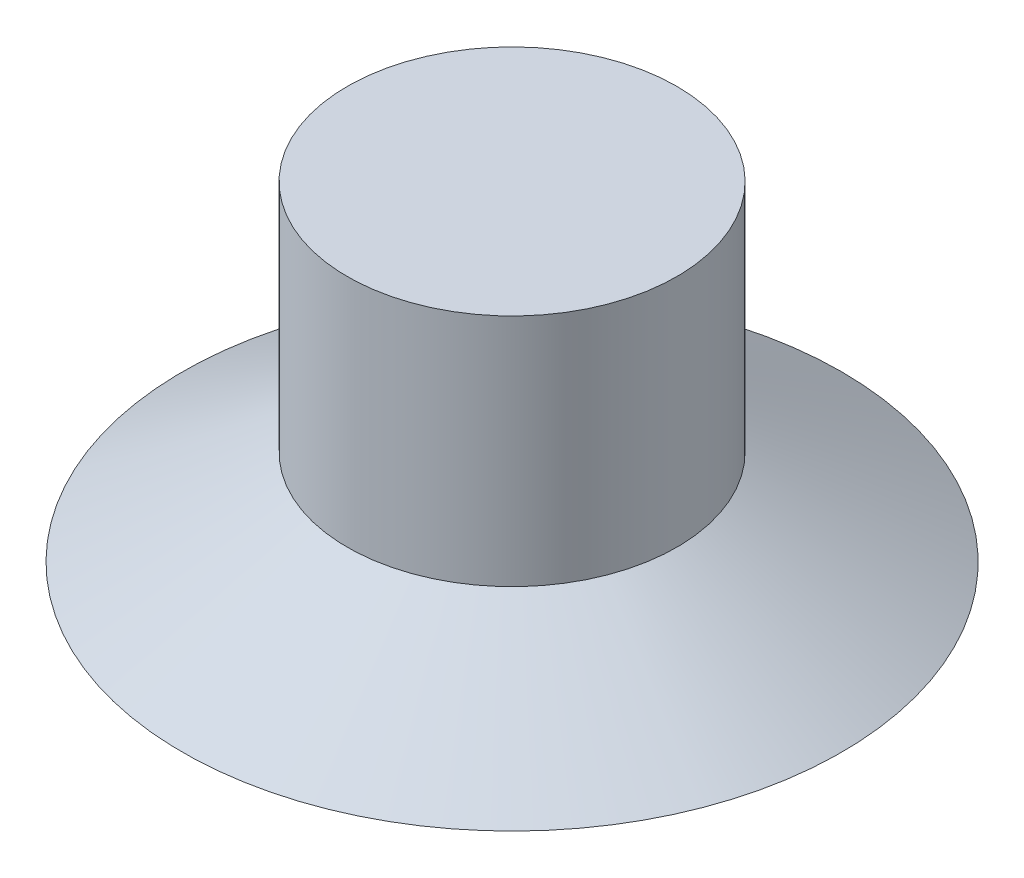
ISO-10303-21;
HEADER;
FILE_DESCRIPTION(('STEP AP214'),'2;1');
FILE_NAME('part.step','',(''),(''),'','','');
FILE_SCHEMA(('AUTOMOTIVE_DESIGN { 1 0 10303 214 1 1 1 1 }'));
ENDSEC;
DATA;
#1=APPLICATION_CONTEXT('core data for automotive mechanical design processes');
#2=APPLICATION_PROTOCOL_DEFINITION('international standard','automotive_design',2000,#1);
#3=PRODUCT_CONTEXT('',#1,'mechanical');
#4=PRODUCT('Part','Part','',(#3));
#5=PRODUCT_RELATED_PRODUCT_CATEGORY('part','',(#4));
#6=PRODUCT_DEFINITION_FORMATION('','',#4);
#7=PRODUCT_DEFINITION_CONTEXT('part definition',#1,'design');
#8=PRODUCT_DEFINITION('design','',#6,#7);
#9=PRODUCT_DEFINITION_SHAPE('','',#8);
#10=(LENGTH_UNIT() NAMED_UNIT(*) SI_UNIT(.MILLI.,.METRE.));
#11=(NAMED_UNIT(*) PLANE_ANGLE_UNIT() SI_UNIT($,.RADIAN.));
#12=(NAMED_UNIT(*) SI_UNIT($,.STERADIAN.) SOLID_ANGLE_UNIT());
#13=UNCERTAINTY_MEASURE_WITH_UNIT(LENGTH_MEASURE(1.E-05),#10,'distance_accuracy_value','');
#14=(GEOMETRIC_REPRESENTATION_CONTEXT(3) GLOBAL_UNCERTAINTY_ASSIGNED_CONTEXT((#13)) GLOBAL_UNIT_ASSIGNED_CONTEXT((#10,
#11,#12)) REPRESENTATION_CONTEXT('',''));
#15=CARTESIAN_POINT('',(0.,0.,0.));
#16=DIRECTION('',(0.,0.,1.));
#17=DIRECTION('',(1.,0.,0.));
#18=AXIS2_PLACEMENT_3D('',#15,#16,#17);
#19=CARTESIAN_POINT('',(0.,0.,0.));
#20=DIRECTION('',(0.,-1.,0.));
#21=DIRECTION('',(0.,0.,-1.));
#22=AXIS2_PLACEMENT_3D('',#19,#20,#21);
#23=PLANE('',#22);
#24=DIRECTION('',(0.499999999999998,0.,-0.86602540378444));
#25=VECTOR('',#24,1.);
#26=CARTESIAN_POINT('',(-1.73205080756889,0.,-3.));
#27=LINE('',#26,#25);
#28=CARTESIAN_POINT('',(-3.46410161513776,0.,0.));
#29=VERTEX_POINT('',#28);
#30=CARTESIAN_POINT('',(-1.73205080756889,0.,-3.));
#31=VERTEX_POINT('',#30);
#32=EDGE_CURVE('E45',#29,#31,#27,.T.);
#33=ORIENTED_EDGE('',*,*,#32,.F.);
#34=DIRECTION('',(-0.500000000000005,0.,-0.866025403784436));
#35=VECTOR('',#34,1.);
#36=CARTESIAN_POINT('',(-3.46410161513776,0.,0.));
#37=LINE('',#36,#35);
#38=CARTESIAN_POINT('',(-1.73205080756887,0.,3.));
#39=VERTEX_POINT('',#38);
#40=EDGE_CURVE('E114',#39,#29,#37,.T.);
#41=ORIENTED_EDGE('',*,*,#40,.F.);
#42=DIRECTION('',(-1.,0.,0.));
#43=VECTOR('',#42,1.);
#44=CARTESIAN_POINT('',(-1.73205080756887,0.,3.));
#45=LINE('',#44,#43);
#46=CARTESIAN_POINT('',(1.73205080756889,0.,3.));
#47=VERTEX_POINT('',#46);
#48=EDGE_CURVE('E108',#47,#39,#45,.T.);
#49=ORIENTED_EDGE('',*,*,#48,.F.);
#50=DIRECTION('',(-0.499999999999998,0.,0.86602540378444));
#51=VECTOR('',#50,1.);
#52=CARTESIAN_POINT('',(1.73205080756889,0.,3.));
#53=LINE('',#52,#51);
#54=CARTESIAN_POINT('',(3.46410161513776,0.,0.));
#55=VERTEX_POINT('',#54);
#56=EDGE_CURVE('E106',#55,#47,#53,.T.);
#57=ORIENTED_EDGE('',*,*,#56,.F.);
#58=DIRECTION('',(0.500000000000005,0.,0.866025403784436));
#59=VECTOR('',#58,1.);
#60=CARTESIAN_POINT('',(3.46410161513776,0.,0.));
#61=LINE('',#60,#59);
#62=CARTESIAN_POINT('',(1.73205080756887,0.,-3.));
#63=VERTEX_POINT('',#62);
#64=EDGE_CURVE('E88',#63,#55,#61,.T.);
#65=ORIENTED_EDGE('',*,*,#64,.F.);
#66=DIRECTION('',(1.,0.,0.));
#67=VECTOR('',#66,1.);
#68=CARTESIAN_POINT('',(1.73205080756887,0.,-3.));
#69=LINE('',#68,#67);
#70=EDGE_CURVE('E99',#31,#63,#69,.T.);
#71=ORIENTED_EDGE('',*,*,#70,.F.);
#72=EDGE_LOOP('',(#33,#41,#49,#57,#65,#71));
#73=FACE_BOUND('',#72,.T.);
#74=CARTESIAN_POINT('',(0.,0.,0.));
#75=DIRECTION('',(0.,-1.,0.));
#76=DIRECTION('',(0.,0.,-1.));
#77=AXIS2_PLACEMENT_3D('',#74,#75,#76);
#78=CIRCLE('',#77,8.);
#79=CARTESIAN_POINT('',(0.,0.,-8.));
#80=VERTEX_POINT('',#79);
#81=EDGE_CURVE('E11',#80,#80,#78,.T.);
#82=ORIENTED_EDGE('',*,*,#81,.T.);
#83=EDGE_LOOP('',(#82));
#84=FACE_BOUND('',#83,.T.);
#85=ADVANCED_FACE('F31',(#73,#84),#23,.T.);
#86=CARTESIAN_POINT('',(0.,0.,0.));
#87=DIRECTION('',(0.,-1.,0.));
#88=DIRECTION('',(0.,0.,-1.));
#89=AXIS2_PLACEMENT_3D('',#86,#87,#88);
#90=CONICAL_SURFACE('',#89,8.,1.0471975511966);
#91=CARTESIAN_POINT('',(0.,2.30940107675847,0.));
#92=DIRECTION('',(0.,-1.,0.));
#93=DIRECTION('',(0.,0.,-1.));
#94=AXIS2_PLACEMENT_3D('',#91,#92,#93);
#95=CIRCLE('',#94,4.);
#96=CARTESIAN_POINT('',(0.,2.30940107675847,-4.));
#97=VERTEX_POINT('',#96);
#98=EDGE_CURVE('E38',#97,#97,#95,.T.);
#99=ORIENTED_EDGE('',*,*,#98,.T.);
#100=EDGE_LOOP('',(#99));
#101=FACE_BOUND('',#100,.T.);
#102=ORIENTED_EDGE('',*,*,#81,.F.);
#103=EDGE_LOOP('',(#102));
#104=FACE_BOUND('',#103,.T.);
#105=ADVANCED_FACE('F143',(#101,#104),#90,.T.);
#106=CARTESIAN_POINT('',(0.,0.,0.));
#107=DIRECTION('',(0.,-1.,0.));
#108=DIRECTION('',(0.,0.,-1.));
#109=AXIS2_PLACEMENT_3D('',#106,#107,#108);
#110=CYLINDRICAL_SURFACE('',#109,4.);
#111=CARTESIAN_POINT('',(0.,8.,0.));
#112=DIRECTION('',(0.,-1.,0.));
#113=DIRECTION('',(0.,0.,-1.));
#114=AXIS2_PLACEMENT_3D('',#111,#112,#113);
#115=CIRCLE('',#114,4.);
#116=CARTESIAN_POINT('',(0.,8.,-4.));
#117=VERTEX_POINT('',#116);
#118=EDGE_CURVE('E132',#117,#117,#115,.T.);
#119=ORIENTED_EDGE('',*,*,#118,.T.);
#120=EDGE_LOOP('',(#119));
#121=FACE_BOUND('',#120,.T.);
#122=ORIENTED_EDGE('',*,*,#98,.F.);
#123=EDGE_LOOP('',(#122));
#124=FACE_BOUND('',#123,.T.);
#125=ADVANCED_FACE('F146',(#121,#124),#110,.T.);
#126=CARTESIAN_POINT('',(4.,8.,0.));
#127=DIRECTION('',(0.,1.,0.));
#128=DIRECTION('',(0.,0.,1.));
#129=AXIS2_PLACEMENT_3D('',#126,#127,#128);
#130=PLANE('',#129);
#131=ORIENTED_EDGE('',*,*,#118,.F.);
#132=EDGE_LOOP('',(#131));
#133=FACE_BOUND('',#132,.T.);
#134=ADVANCED_FACE('F148',(#133),#130,.T.);
#135=CARTESIAN_POINT('',(-1.73205080756889,3.,-3.));
#136=DIRECTION('',(-0.86602540378444,0.,-0.499999999999998));
#137=DIRECTION('',(-0.499999999999998,0.,0.86602540378444));
#138=AXIS2_PLACEMENT_3D('',#135,#136,#137);
#139=PLANE('',#138);
#140=ORIENTED_EDGE('',*,*,#32,.T.);
#141=DIRECTION('',(0.,-1.,0.));
#142=VECTOR('',#141,1.);
#143=CARTESIAN_POINT('',(-1.73205080756889,3.,-3.));
#144=LINE('',#143,#142);
#145=CARTESIAN_POINT('',(-1.73205080756889,3.,-3.));
#146=VERTEX_POINT('',#145);
#147=EDGE_CURVE('E96',#146,#31,#144,.T.);
#148=ORIENTED_EDGE('',*,*,#147,.F.);
#149=DIRECTION('',(0.499999999999998,0.,-0.86602540378444));
#150=VECTOR('',#149,1.);
#151=CARTESIAN_POINT('',(-1.73205080756889,3.,-3.));
#152=LINE('',#151,#150);
#153=CARTESIAN_POINT('',(-3.46410161513776,3.,0.));
#154=VERTEX_POINT('',#153);
#155=EDGE_CURVE('E116',#154,#146,#152,.T.);
#156=ORIENTED_EDGE('',*,*,#155,.F.);
#157=DIRECTION('',(0.,-1.,0.));
#158=VECTOR('',#157,1.);
#159=CARTESIAN_POINT('',(-3.46410161513776,3.,0.));
#160=LINE('',#159,#158);
#161=EDGE_CURVE('E52',#154,#29,#160,.T.);
#162=ORIENTED_EDGE('',*,*,#161,.T.);
#163=EDGE_LOOP('',(#140,#148,#156,#162));
#164=FACE_BOUND('',#163,.T.);
#165=ADVANCED_FACE('F155',(#164),#139,.F.);
#166=CARTESIAN_POINT('',(-3.46410161513776,3.,0.));
#167=DIRECTION('',(-0.866025403784436,0.,0.500000000000004));
#168=DIRECTION('',(0.500000000000005,0.,0.866025403784436));
#169=AXIS2_PLACEMENT_3D('',#166,#167,#168);
#170=PLANE('',#169);
#171=ORIENTED_EDGE('',*,*,#40,.T.);
#172=ORIENTED_EDGE('',*,*,#161,.F.);
#173=DIRECTION('',(-0.500000000000005,0.,-0.866025403784436));
#174=VECTOR('',#173,1.);
#175=CARTESIAN_POINT('',(-3.46410161513776,3.,0.));
#176=LINE('',#175,#174);
#177=CARTESIAN_POINT('',(-1.73205080756887,3.,3.));
#178=VERTEX_POINT('',#177);
#179=EDGE_CURVE('E128',#178,#154,#176,.T.);
#180=ORIENTED_EDGE('',*,*,#179,.F.);
#181=DIRECTION('',(0.,-1.,0.));
#182=VECTOR('',#181,1.);
#183=CARTESIAN_POINT('',(-1.73205080756887,3.,3.));
#184=LINE('',#183,#182);
#185=EDGE_CURVE('E133',#178,#39,#184,.T.);
#186=ORIENTED_EDGE('',*,*,#185,.T.);
#187=EDGE_LOOP('',(#171,#172,#180,#186));
#188=FACE_BOUND('',#187,.T.);
#189=ADVANCED_FACE('F184',(#188),#170,.F.);
#190=CARTESIAN_POINT('',(-1.73205080756887,3.,3.));
#191=DIRECTION('',(0.,0.,1.));
#192=DIRECTION('',(1.,0.,0.));
#193=AXIS2_PLACEMENT_3D('',#190,#191,#192);
#194=PLANE('',#193);
#195=ORIENTED_EDGE('',*,*,#48,.T.);
#196=ORIENTED_EDGE('',*,*,#185,.F.);
#197=DIRECTION('',(-1.,0.,0.));
#198=VECTOR('',#197,1.);
#199=CARTESIAN_POINT('',(-1.73205080756887,3.,3.));
#200=LINE('',#199,#198);
#201=CARTESIAN_POINT('',(1.73205080756889,3.,3.));
#202=VERTEX_POINT('',#201);
#203=EDGE_CURVE('E125',#202,#178,#200,.T.);
#204=ORIENTED_EDGE('',*,*,#203,.F.);
#205=DIRECTION('',(0.,-1.,0.));
#206=VECTOR('',#205,1.);
#207=CARTESIAN_POINT('',(1.73205080756889,3.,3.));
#208=LINE('',#207,#206);
#209=EDGE_CURVE('E135',#202,#47,#208,.T.);
#210=ORIENTED_EDGE('',*,*,#209,.T.);
#211=EDGE_LOOP('',(#195,#196,#204,#210));
#212=FACE_BOUND('',#211,.T.);
#213=ADVANCED_FACE('F190',(#212),#194,.F.);
#214=CARTESIAN_POINT('',(1.73205080756889,3.,3.));
#215=DIRECTION('',(0.86602540378444,0.,0.499999999999998));
#216=DIRECTION('',(0.499999999999998,0.,-0.86602540378444));
#217=AXIS2_PLACEMENT_3D('',#214,#215,#216);
#218=PLANE('',#217);
#219=ORIENTED_EDGE('',*,*,#56,.T.);
#220=ORIENTED_EDGE('',*,*,#209,.F.);
#221=DIRECTION('',(-0.499999999999998,0.,0.86602540378444));
#222=VECTOR('',#221,1.);
#223=CARTESIAN_POINT('',(1.73205080756889,3.,3.));
#224=LINE('',#223,#222);
#225=CARTESIAN_POINT('',(3.46410161513776,3.,0.));
#226=VERTEX_POINT('',#225);
#227=EDGE_CURVE('E122',#226,#202,#224,.T.);
#228=ORIENTED_EDGE('',*,*,#227,.F.);
#229=DIRECTION('',(0.,-1.,0.));
#230=VECTOR('',#229,1.);
#231=CARTESIAN_POINT('',(3.46410161513776,3.,0.));
#232=LINE('',#231,#230);
#233=EDGE_CURVE('E95',#226,#55,#232,.T.);
#234=ORIENTED_EDGE('',*,*,#233,.T.);
#235=EDGE_LOOP('',(#219,#220,#228,#234));
#236=FACE_BOUND('',#235,.T.);
#237=ADVANCED_FACE('F197',(#236),#218,.F.);
#238=CARTESIAN_POINT('',(3.46410161513776,3.,0.));
#239=DIRECTION('',(0.866025403784436,0.,-0.500000000000005));
#240=DIRECTION('',(-0.500000000000005,0.,-0.866025403784436));
#241=AXIS2_PLACEMENT_3D('',#238,#239,#240);
#242=PLANE('',#241);
#243=ORIENTED_EDGE('',*,*,#64,.T.);
#244=ORIENTED_EDGE('',*,*,#233,.F.);
#245=DIRECTION('',(0.500000000000005,0.,0.866025403784436));
#246=VECTOR('',#245,1.);
#247=CARTESIAN_POINT('',(3.46410161513776,3.,0.));
#248=LINE('',#247,#246);
#249=CARTESIAN_POINT('',(1.73205080756887,3.,-3.));
#250=VERTEX_POINT('',#249);
#251=EDGE_CURVE('E91',#250,#226,#248,.T.);
#252=ORIENTED_EDGE('',*,*,#251,.F.);
#253=DIRECTION('',(0.,-1.,0.));
#254=VECTOR('',#253,1.);
#255=CARTESIAN_POINT('',(1.73205080756887,3.,-3.));
#256=LINE('',#255,#254);
#257=EDGE_CURVE('E84',#250,#63,#256,.T.);
#258=ORIENTED_EDGE('',*,*,#257,.T.);
#259=EDGE_LOOP('',(#243,#244,#252,#258));
#260=FACE_BOUND('',#259,.T.);
#261=ADVANCED_FACE('F86',(#260),#242,.F.);
#262=CARTESIAN_POINT('',(1.73205080756887,3.,-3.));
#263=DIRECTION('',(0.,0.,-1.));
#264=DIRECTION('',(-1.,0.,0.));
#265=AXIS2_PLACEMENT_3D('',#262,#263,#264);
#266=PLANE('',#265);
#267=ORIENTED_EDGE('',*,*,#70,.T.);
#268=ORIENTED_EDGE('',*,*,#257,.F.);
#269=DIRECTION('',(1.,0.,0.));
#270=VECTOR('',#269,1.);
#271=CARTESIAN_POINT('',(1.73205080756887,3.,-3.));
#272=LINE('',#271,#270);
#273=EDGE_CURVE('E119',#146,#250,#272,.T.);
#274=ORIENTED_EDGE('',*,*,#273,.F.);
#275=ORIENTED_EDGE('',*,*,#147,.T.);
#276=EDGE_LOOP('',(#267,#268,#274,#275));
#277=FACE_BOUND('',#276,.T.);
#278=ADVANCED_FACE('F100',(#277),#266,.F.);
#279=CARTESIAN_POINT('',(-5.19615242270662,3.,3.));
#280=DIRECTION('',(0.,1.,0.));
#281=DIRECTION('',(0.,0.,1.));
#282=AXIS2_PLACEMENT_3D('',#279,#280,#281);
#283=PLANE('',#282);
#284=ORIENTED_EDGE('',*,*,#155,.T.);
#285=ORIENTED_EDGE('',*,*,#273,.T.);
#286=ORIENTED_EDGE('',*,*,#251,.T.);
#287=ORIENTED_EDGE('',*,*,#227,.T.);
#288=ORIENTED_EDGE('',*,*,#203,.T.);
#289=ORIENTED_EDGE('',*,*,#179,.T.);
#290=EDGE_LOOP('',(#284,#285,#286,#287,#288,#289));
#291=FACE_BOUND('',#290,.T.);
#292=ADVANCED_FACE('F218',(#291),#283,.F.);
#293=CLOSED_SHELL('',(#85,#105,#125,#134,#165,#189,#213,#237,#261,#278,#292));
#294=MANIFOLD_SOLID_BREP('B2',#293);
#295=ADVANCED_BREP_SHAPE_REPRESENTATION('',(#18,#294),#14);
#296=SHAPE_DEFINITION_REPRESENTATION(#9,#295);
ENDSEC;
END-ISO-10303-21;
